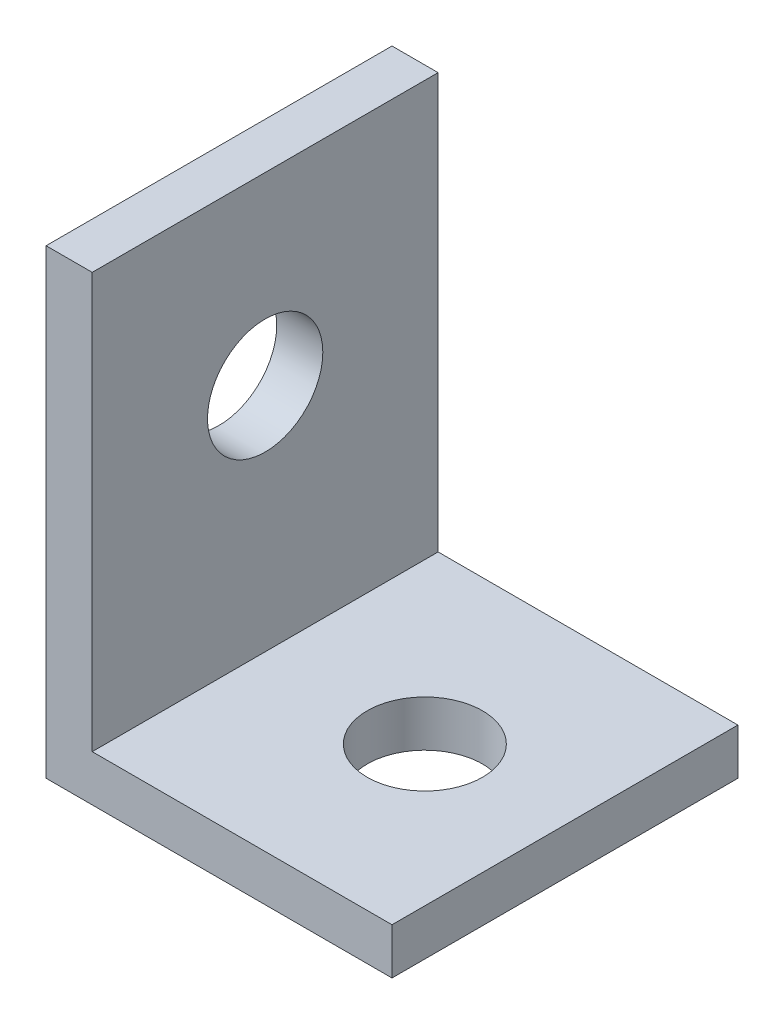
ISO-10303-21;
HEADER;
FILE_DESCRIPTION(('STEP AP214'),'2;1');
FILE_NAME('part.step','',(''),(''),'','','');
FILE_SCHEMA(('AUTOMOTIVE_DESIGN { 1 0 10303 214 1 1 1 1 }'));
ENDSEC;
DATA;
#1=APPLICATION_CONTEXT('core data for automotive mechanical design processes');
#2=APPLICATION_PROTOCOL_DEFINITION('international standard','automotive_design',2000,#1);
#3=PRODUCT_CONTEXT('',#1,'mechanical');
#4=PRODUCT('Part','Part','',(#3));
#5=PRODUCT_RELATED_PRODUCT_CATEGORY('part','',(#4));
#6=PRODUCT_DEFINITION_FORMATION('','',#4);
#7=PRODUCT_DEFINITION_CONTEXT('part definition',#1,'design');
#8=PRODUCT_DEFINITION('design','',#6,#7);
#9=PRODUCT_DEFINITION_SHAPE('','',#8);
#10=(LENGTH_UNIT() NAMED_UNIT(*) SI_UNIT(.MILLI.,.METRE.));
#11=(NAMED_UNIT(*) PLANE_ANGLE_UNIT() SI_UNIT($,.RADIAN.));
#12=(NAMED_UNIT(*) SI_UNIT($,.STERADIAN.) SOLID_ANGLE_UNIT());
#13=UNCERTAINTY_MEASURE_WITH_UNIT(LENGTH_MEASURE(1.E-05),#10,'distance_accuracy_value','');
#14=(GEOMETRIC_REPRESENTATION_CONTEXT(3) GLOBAL_UNCERTAINTY_ASSIGNED_CONTEXT((#13)) GLOBAL_UNIT_ASSIGNED_CONTEXT((#10,
#11,#12)) REPRESENTATION_CONTEXT('',''));
#15=CARTESIAN_POINT('',(0.,0.,0.));
#16=DIRECTION('',(0.,0.,1.));
#17=DIRECTION('',(1.,0.,0.));
#18=AXIS2_PLACEMENT_3D('',#15,#16,#17);
#19=CARTESIAN_POINT('',(0.,0.,19.05));
#20=DIRECTION('',(0.,1.,0.));
#21=DIRECTION('',(0.,0.,1.));
#22=AXIS2_PLACEMENT_3D('',#19,#20,#21);
#23=PLANE('',#22);
#24=CARTESIAN_POINT('',(11.334166685117,0.,9.525));
#25=DIRECTION('',(0.,1.,0.));
#26=DIRECTION('',(0.,0.,1.));
#27=AXIS2_PLACEMENT_3D('',#24,#25,#26);
#28=CIRCLE('',#27,3.175);
#29=CARTESIAN_POINT('',(11.334166685117,0.,12.7));
#30=VERTEX_POINT('',#29);
#31=EDGE_CURVE('E162',#30,#30,#28,.T.);
#32=ORIENTED_EDGE('',*,*,#31,.T.);
#33=EDGE_LOOP('',(#32));
#34=FACE_BOUND('',#33,.T.);
#35=DIRECTION('',(1.,0.,0.));
#36=VECTOR('',#35,1.);
#37=CARTESIAN_POINT('',(0.,0.,0.));
#38=LINE('',#37,#36);
#39=CARTESIAN_POINT('',(0.,0.,0.));
#40=VERTEX_POINT('',#39);
#41=CARTESIAN_POINT('',(19.05,0.,0.));
#42=VERTEX_POINT('',#41);
#43=EDGE_CURVE('E118',#40,#42,#38,.T.);
#44=ORIENTED_EDGE('',*,*,#43,.T.);
#45=DIRECTION('',(0.,0.,-1.));
#46=VECTOR('',#45,1.);
#47=CARTESIAN_POINT('',(19.05,0.,19.05));
#48=LINE('',#47,#46);
#49=CARTESIAN_POINT('',(19.05,0.,19.05));
#50=VERTEX_POINT('',#49);
#51=EDGE_CURVE('E11',#50,#42,#48,.T.);
#52=ORIENTED_EDGE('',*,*,#51,.F.);
#53=DIRECTION('',(1.,0.,0.));
#54=VECTOR('',#53,1.);
#55=CARTESIAN_POINT('',(0.,0.,19.05));
#56=LINE('',#55,#54);
#57=CARTESIAN_POINT('',(0.,0.,19.05));
#58=VERTEX_POINT('',#57);
#59=EDGE_CURVE('E128',#58,#50,#56,.T.);
#60=ORIENTED_EDGE('',*,*,#59,.F.);
#61=DIRECTION('',(0.,0.,-1.));
#62=VECTOR('',#61,1.);
#63=CARTESIAN_POINT('',(0.,0.,19.05));
#64=LINE('',#63,#62);
#65=EDGE_CURVE('E114',#58,#40,#64,.T.);
#66=ORIENTED_EDGE('',*,*,#65,.T.);
#67=EDGE_LOOP('',(#44,#52,#60,#66));
#68=FACE_BOUND('',#67,.T.);
#69=ADVANCED_FACE('F33',(#34,#68),#23,.F.);
#70=CARTESIAN_POINT('',(19.05,0.,19.05));
#71=DIRECTION('',(-1.,0.,0.));
#72=DIRECTION('',(0.,-1.,0.));
#73=AXIS2_PLACEMENT_3D('',#70,#71,#72);
#74=PLANE('',#73);
#75=DIRECTION('',(0.,1.,0.));
#76=VECTOR('',#75,1.);
#77=CARTESIAN_POINT('',(19.05,0.,0.));
#78=LINE('',#77,#76);
#79=CARTESIAN_POINT('',(19.05,2.54,0.));
#80=VERTEX_POINT('',#79);
#81=EDGE_CURVE('E121',#42,#80,#78,.T.);
#82=ORIENTED_EDGE('',*,*,#81,.T.);
#83=DIRECTION('',(0.,0.,-1.));
#84=VECTOR('',#83,1.);
#85=CARTESIAN_POINT('',(19.05,2.54,19.05));
#86=LINE('',#85,#84);
#87=CARTESIAN_POINT('',(19.05,2.54,19.05));
#88=VERTEX_POINT('',#87);
#89=EDGE_CURVE('E42',#88,#80,#86,.T.);
#90=ORIENTED_EDGE('',*,*,#89,.F.);
#91=DIRECTION('',(0.,1.,0.));
#92=VECTOR('',#91,1.);
#93=CARTESIAN_POINT('',(19.05,0.,19.05));
#94=LINE('',#93,#92);
#95=EDGE_CURVE('E87',#50,#88,#94,.T.);
#96=ORIENTED_EDGE('',*,*,#95,.F.);
#97=ORIENTED_EDGE('',*,*,#51,.T.);
#98=EDGE_LOOP('',(#82,#90,#96,#97));
#99=FACE_BOUND('',#98,.T.);
#100=ADVANCED_FACE('F155',(#99),#74,.F.);
#101=CARTESIAN_POINT('',(2.54,2.54,19.05));
#102=DIRECTION('',(0.,-1.,0.));
#103=DIRECTION('',(0.,0.,-1.));
#104=AXIS2_PLACEMENT_3D('',#101,#102,#103);
#105=PLANE('',#104);
#106=CARTESIAN_POINT('',(11.334166685117,2.54,9.525));
#107=DIRECTION('',(0.,1.,0.));
#108=DIRECTION('',(0.,0.,1.));
#109=AXIS2_PLACEMENT_3D('',#106,#107,#108);
#110=CIRCLE('',#109,3.175);
#111=CARTESIAN_POINT('',(11.334166685117,2.54,12.7));
#112=VERTEX_POINT('',#111);
#113=EDGE_CURVE('E165',#112,#112,#110,.T.);
#114=ORIENTED_EDGE('',*,*,#113,.F.);
#115=EDGE_LOOP('',(#114));
#116=FACE_BOUND('',#115,.T.);
#117=DIRECTION('',(-1.,0.,0.));
#118=VECTOR('',#117,1.);
#119=CARTESIAN_POINT('',(2.54,2.54,0.));
#120=LINE('',#119,#118);
#121=CARTESIAN_POINT('',(2.54,2.54,0.));
#122=VERTEX_POINT('',#121);
#123=EDGE_CURVE('E123',#80,#122,#120,.T.);
#124=ORIENTED_EDGE('',*,*,#123,.T.);
#125=DIRECTION('',(0.,0.,-1.));
#126=VECTOR('',#125,1.);
#127=CARTESIAN_POINT('',(2.54,2.54,19.05));
#128=LINE('',#127,#126);
#129=CARTESIAN_POINT('',(2.54,2.54,19.05));
#130=VERTEX_POINT('',#129);
#131=EDGE_CURVE('E109',#130,#122,#128,.T.);
#132=ORIENTED_EDGE('',*,*,#131,.F.);
#133=DIRECTION('',(-1.,0.,0.));
#134=VECTOR('',#133,1.);
#135=CARTESIAN_POINT('',(2.54,2.54,19.05));
#136=LINE('',#135,#134);
#137=EDGE_CURVE('E100',#88,#130,#136,.T.);
#138=ORIENTED_EDGE('',*,*,#137,.F.);
#139=ORIENTED_EDGE('',*,*,#89,.T.);
#140=EDGE_LOOP('',(#124,#132,#138,#139));
#141=FACE_BOUND('',#140,.T.);
#142=ADVANCED_FACE('F135',(#116,#141),#105,.F.);
#143=CARTESIAN_POINT('',(2.54,2.54,19.05));
#144=DIRECTION('',(-1.,0.,0.));
#145=DIRECTION('',(0.,0.,1.));
#146=AXIS2_PLACEMENT_3D('',#143,#144,#145);
#147=PLANE('',#146);
#148=CARTESIAN_POINT('',(2.54,15.24,9.525));
#149=DIRECTION('',(1.,0.,0.));
#150=DIRECTION('',(0.,0.,-1.));
#151=AXIS2_PLACEMENT_3D('',#148,#149,#150);
#152=CIRCLE('',#151,3.175);
#153=CARTESIAN_POINT('',(2.54,15.24,6.35));
#154=VERTEX_POINT('',#153);
#155=EDGE_CURVE('E164',#154,#154,#152,.T.);
#156=ORIENTED_EDGE('',*,*,#155,.F.);
#157=EDGE_LOOP('',(#156));
#158=FACE_BOUND('',#157,.T.);
#159=DIRECTION('',(0.,1.,0.));
#160=VECTOR('',#159,1.);
#161=CARTESIAN_POINT('',(2.54,2.54,0.));
#162=LINE('',#161,#160);
#163=CARTESIAN_POINT('',(2.54,25.4,0.));
#164=VERTEX_POINT('',#163);
#165=EDGE_CURVE('E108',#122,#164,#162,.T.);
#166=ORIENTED_EDGE('',*,*,#165,.T.);
#167=DIRECTION('',(0.,0.,-1.));
#168=VECTOR('',#167,1.);
#169=CARTESIAN_POINT('',(2.54,25.4,19.05));
#170=LINE('',#169,#168);
#171=CARTESIAN_POINT('',(2.54,25.4,19.05));
#172=VERTEX_POINT('',#171);
#173=EDGE_CURVE('E105',#172,#164,#170,.T.);
#174=ORIENTED_EDGE('',*,*,#173,.F.);
#175=DIRECTION('',(0.,1.,0.));
#176=VECTOR('',#175,1.);
#177=CARTESIAN_POINT('',(2.54,2.54,19.05));
#178=LINE('',#177,#176);
#179=EDGE_CURVE('E94',#130,#172,#178,.T.);
#180=ORIENTED_EDGE('',*,*,#179,.F.);
#181=ORIENTED_EDGE('',*,*,#131,.T.);
#182=EDGE_LOOP('',(#166,#174,#180,#181));
#183=FACE_BOUND('',#182,.T.);
#184=ADVANCED_FACE('F106',(#158,#183),#147,.F.);
#185=CARTESIAN_POINT('',(0.,25.4,19.05));
#186=DIRECTION('',(0.,-1.,0.));
#187=DIRECTION('',(0.,0.,-1.));
#188=AXIS2_PLACEMENT_3D('',#185,#186,#187);
#189=PLANE('',#188);
#190=DIRECTION('',(-1.,0.,0.));
#191=VECTOR('',#190,1.);
#192=CARTESIAN_POINT('',(0.,25.4,0.));
#193=LINE('',#192,#191);
#194=CARTESIAN_POINT('',(0.,25.4,0.));
#195=VERTEX_POINT('',#194);
#196=EDGE_CURVE('E73',#164,#195,#193,.T.);
#197=ORIENTED_EDGE('',*,*,#196,.T.);
#198=DIRECTION('',(0.,0.,-1.));
#199=VECTOR('',#198,1.);
#200=CARTESIAN_POINT('',(0.,25.4,19.05));
#201=LINE('',#200,#199);
#202=CARTESIAN_POINT('',(0.,25.4,19.05));
#203=VERTEX_POINT('',#202);
#204=EDGE_CURVE('E110',#203,#195,#201,.T.);
#205=ORIENTED_EDGE('',*,*,#204,.F.);
#206=DIRECTION('',(-1.,0.,0.));
#207=VECTOR('',#206,1.);
#208=CARTESIAN_POINT('',(0.,25.4,19.05));
#209=LINE('',#208,#207);
#210=EDGE_CURVE('E98',#172,#203,#209,.T.);
#211=ORIENTED_EDGE('',*,*,#210,.F.);
#212=ORIENTED_EDGE('',*,*,#173,.T.);
#213=EDGE_LOOP('',(#197,#205,#211,#212));
#214=FACE_BOUND('',#213,.T.);
#215=ADVANCED_FACE('F112',(#214),#189,.F.);
#216=CARTESIAN_POINT('',(0.,0.,19.05));
#217=DIRECTION('',(1.,0.,0.));
#218=DIRECTION('',(0.,0.,-1.));
#219=AXIS2_PLACEMENT_3D('',#216,#217,#218);
#220=PLANE('',#219);
#221=CARTESIAN_POINT('',(0.,15.24,9.525));
#222=DIRECTION('',(1.,0.,0.));
#223=DIRECTION('',(0.,0.,-1.));
#224=AXIS2_PLACEMENT_3D('',#221,#222,#223);
#225=CIRCLE('',#224,3.175);
#226=CARTESIAN_POINT('',(0.,15.24,6.35));
#227=VERTEX_POINT('',#226);
#228=EDGE_CURVE('E36',#227,#227,#225,.T.);
#229=ORIENTED_EDGE('',*,*,#228,.T.);
#230=EDGE_LOOP('',(#229));
#231=FACE_BOUND('',#230,.T.);
#232=DIRECTION('',(0.,-1.,0.));
#233=VECTOR('',#232,1.);
#234=CARTESIAN_POINT('',(0.,0.,0.));
#235=LINE('',#234,#233);
#236=EDGE_CURVE('E79',#195,#40,#235,.T.);
#237=ORIENTED_EDGE('',*,*,#236,.T.);
#238=ORIENTED_EDGE('',*,*,#65,.F.);
#239=DIRECTION('',(0.,-1.,0.));
#240=VECTOR('',#239,1.);
#241=CARTESIAN_POINT('',(0.,0.,19.05));
#242=LINE('',#241,#240);
#243=EDGE_CURVE('E50',#203,#58,#242,.T.);
#244=ORIENTED_EDGE('',*,*,#243,.F.);
#245=ORIENTED_EDGE('',*,*,#204,.T.);
#246=EDGE_LOOP('',(#237,#238,#244,#245));
#247=FACE_BOUND('',#246,.T.);
#248=ADVANCED_FACE('F142',(#231,#247),#220,.F.);
#249=CARTESIAN_POINT('',(0.,0.,19.05));
#250=DIRECTION('',(0.,0.,1.));
#251=DIRECTION('',(1.,0.,0.));
#252=AXIS2_PLACEMENT_3D('',#249,#250,#251);
#253=PLANE('',#252);
#254=ORIENTED_EDGE('',*,*,#59,.T.);
#255=ORIENTED_EDGE('',*,*,#95,.T.);
#256=ORIENTED_EDGE('',*,*,#137,.T.);
#257=ORIENTED_EDGE('',*,*,#179,.T.);
#258=ORIENTED_EDGE('',*,*,#210,.T.);
#259=ORIENTED_EDGE('',*,*,#243,.T.);
#260=EDGE_LOOP('',(#254,#255,#256,#257,#258,#259));
#261=FACE_BOUND('',#260,.T.);
#262=ADVANCED_FACE('F96',(#261),#253,.T.);
#263=CARTESIAN_POINT('',(0.,0.,0.));
#264=DIRECTION('',(0.,0.,1.));
#265=DIRECTION('',(1.,0.,0.));
#266=AXIS2_PLACEMENT_3D('',#263,#264,#265);
#267=PLANE('',#266);
#268=ORIENTED_EDGE('',*,*,#43,.F.);
#269=ORIENTED_EDGE('',*,*,#236,.F.);
#270=ORIENTED_EDGE('',*,*,#196,.F.);
#271=ORIENTED_EDGE('',*,*,#165,.F.);
#272=ORIENTED_EDGE('',*,*,#123,.F.);
#273=ORIENTED_EDGE('',*,*,#81,.F.);
#274=EDGE_LOOP('',(#268,#269,#270,#271,#272,#273));
#275=FACE_BOUND('',#274,.T.);
#276=ADVANCED_FACE('F138',(#275),#267,.F.);
#277=CARTESIAN_POINT('',(-16.51,15.24,9.525));
#278=DIRECTION('',(1.,0.,0.));
#279=DIRECTION('',(0.,0.,-1.));
#280=AXIS2_PLACEMENT_3D('',#277,#278,#279);
#281=CYLINDRICAL_SURFACE('',#280,3.175);
#282=ORIENTED_EDGE('',*,*,#155,.T.);
#283=EDGE_LOOP('',(#282));
#284=FACE_BOUND('',#283,.T.);
#285=ORIENTED_EDGE('',*,*,#228,.F.);
#286=EDGE_LOOP('',(#285));
#287=FACE_BOUND('',#286,.T.);
#288=ADVANCED_FACE('F188',(#284,#287),#281,.F.);
#289=CARTESIAN_POINT('',(11.334166685117,-16.51,9.525));
#290=DIRECTION('',(0.,1.,0.));
#291=DIRECTION('',(0.,0.,1.));
#292=AXIS2_PLACEMENT_3D('',#289,#290,#291);
#293=CYLINDRICAL_SURFACE('',#292,3.175);
#294=ORIENTED_EDGE('',*,*,#113,.T.);
#295=EDGE_LOOP('',(#294));
#296=FACE_BOUND('',#295,.T.);
#297=ORIENTED_EDGE('',*,*,#31,.F.);
#298=EDGE_LOOP('',(#297));
#299=FACE_BOUND('',#298,.T.);
#300=ADVANCED_FACE('F175',(#296,#299),#293,.F.);
#301=CLOSED_SHELL('',(#69,#100,#142,#184,#215,#248,#262,#276,#288,#300));
#302=MANIFOLD_SOLID_BREP('B2',#301);
#303=ADVANCED_BREP_SHAPE_REPRESENTATION('',(#18,#302),#14);
#304=SHAPE_DEFINITION_REPRESENTATION(#9,#303);
ENDSEC;
END-ISO-10303-21;
